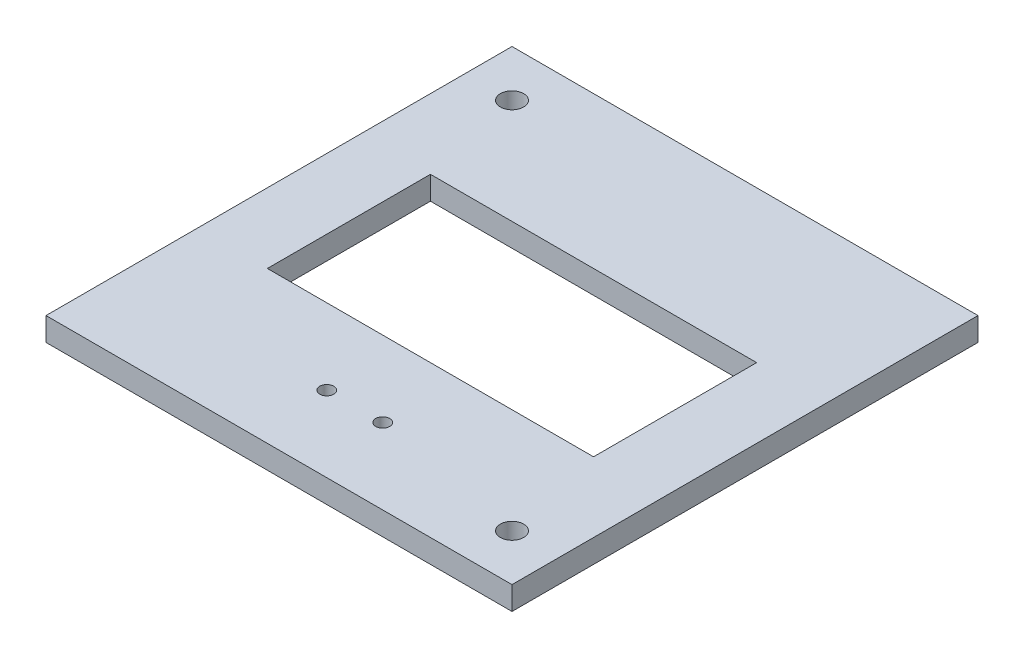
ISO-10303-21;
HEADER;
FILE_DESCRIPTION(('STEP AP214'),'2;1');
FILE_NAME('part.step','',(''),(''),'','','');
FILE_SCHEMA(('AUTOMOTIVE_DESIGN { 1 0 10303 214 1 1 1 1 }'));
ENDSEC;
DATA;
#1=APPLICATION_CONTEXT('core data for automotive mechanical design processes');
#2=APPLICATION_PROTOCOL_DEFINITION('international standard','automotive_design',2000,#1);
#3=PRODUCT_CONTEXT('',#1,'mechanical');
#4=PRODUCT('Part','Part','',(#3));
#5=PRODUCT_RELATED_PRODUCT_CATEGORY('part','',(#4));
#6=PRODUCT_DEFINITION_FORMATION('','',#4);
#7=PRODUCT_DEFINITION_CONTEXT('part definition',#1,'design');
#8=PRODUCT_DEFINITION('design','',#6,#7);
#9=PRODUCT_DEFINITION_SHAPE('','',#8);
#10=(LENGTH_UNIT() NAMED_UNIT(*) SI_UNIT(.MILLI.,.METRE.));
#11=(NAMED_UNIT(*) PLANE_ANGLE_UNIT() SI_UNIT($,.RADIAN.));
#12=(NAMED_UNIT(*) SI_UNIT($,.STERADIAN.) SOLID_ANGLE_UNIT());
#13=UNCERTAINTY_MEASURE_WITH_UNIT(LENGTH_MEASURE(1.E-05),#10,'distance_accuracy_value','');
#14=(GEOMETRIC_REPRESENTATION_CONTEXT(3) GLOBAL_UNCERTAINTY_ASSIGNED_CONTEXT((#13)) GLOBAL_UNIT_ASSIGNED_CONTEXT((#10,
#11,#12)) REPRESENTATION_CONTEXT('',''));
#15=CARTESIAN_POINT('',(0.,0.,0.));
#16=DIRECTION('',(0.,0.,1.));
#17=DIRECTION('',(1.,0.,0.));
#18=AXIS2_PLACEMENT_3D('',#15,#16,#17);
#19=CARTESIAN_POINT('',(0.,5.,0.));
#20=DIRECTION('',(0.,1.,0.));
#21=DIRECTION('',(0.,0.,1.));
#22=AXIS2_PLACEMENT_3D('',#19,#20,#21);
#23=PLANE('',#22);
#24=CARTESIAN_POINT('',(-90.,5.,-90.));
#25=DIRECTION('',(0.,1.,0.));
#26=DIRECTION('',(0.,0.,1.));
#27=AXIS2_PLACEMENT_3D('',#24,#25,#26);
#28=CIRCLE('',#27,2.50000000000001);
#29=CARTESIAN_POINT('',(-90.,5.,-87.5));
#30=VERTEX_POINT('',#29);
#31=EDGE_CURVE('E277',#30,#30,#28,.T.);
#32=ORIENTED_EDGE('',*,*,#31,.F.);
#33=EDGE_LOOP('',(#32));
#34=FACE_BOUND('',#33,.T.);
#35=CARTESIAN_POINT('',(-56.,5.,-16.25));
#36=DIRECTION('',(0.,1.,0.));
#37=DIRECTION('',(0.,0.,1.));
#38=AXIS2_PLACEMENT_3D('',#35,#36,#37);
#39=CIRCLE('',#38,1.5);
#40=CARTESIAN_POINT('',(-56.,5.,-14.75));
#41=VERTEX_POINT('',#40);
#42=EDGE_CURVE('E140',#41,#41,#39,.T.);
#43=ORIENTED_EDGE('',*,*,#42,.F.);
#44=EDGE_LOOP('',(#43));
#45=FACE_BOUND('',#44,.T.);
#46=DIRECTION('',(0.,0.,1.));
#47=VECTOR('',#46,1.);
#48=CARTESIAN_POINT('',(-100.,5.,-100.));
#49=LINE('',#48,#47);
#50=CARTESIAN_POINT('',(-100.,5.,-100.));
#51=VERTEX_POINT('',#50);
#52=CARTESIAN_POINT('',(-100.,5.,0.));
#53=VERTEX_POINT('',#52);
#54=EDGE_CURVE('E156',#51,#53,#49,.T.);
#55=ORIENTED_EDGE('',*,*,#54,.T.);
#56=DIRECTION('',(1.,0.,0.));
#57=VECTOR('',#56,1.);
#58=CARTESIAN_POINT('',(-100.,5.,0.));
#59=LINE('',#58,#57);
#60=CARTESIAN_POINT('',(0.,5.,0.));
#61=VERTEX_POINT('',#60);
#62=EDGE_CURVE('E160',#53,#61,#59,.T.);
#63=ORIENTED_EDGE('',*,*,#62,.T.);
#64=DIRECTION('',(0.,0.,-1.));
#65=VECTOR('',#64,1.);
#66=CARTESIAN_POINT('',(0.,5.,-100.));
#67=LINE('',#66,#65);
#68=CARTESIAN_POINT('',(0.,5.,-100.));
#69=VERTEX_POINT('',#68);
#70=EDGE_CURVE('E164',#61,#69,#67,.T.);
#71=ORIENTED_EDGE('',*,*,#70,.T.);
#72=DIRECTION('',(-1.,0.,0.));
#73=VECTOR('',#72,1.);
#74=CARTESIAN_POINT('',(-100.,5.,-100.));
#75=LINE('',#74,#73);
#76=EDGE_CURVE('E167',#69,#51,#75,.T.);
#77=ORIENTED_EDGE('',*,*,#76,.T.);
#78=EDGE_LOOP('',(#55,#63,#71,#77));
#79=FACE_BOUND('',#78,.T.);
#80=DIRECTION('',(1.,0.,0.));
#81=VECTOR('',#80,1.);
#82=CARTESIAN_POINT('',(-85.,5.,-32.5));
#83=LINE('',#82,#81);
#84=CARTESIAN_POINT('',(-85.,5.,-32.5));
#85=VERTEX_POINT('',#84);
#86=CARTESIAN_POINT('',(-15.,5.,-32.5));
#87=VERTEX_POINT('',#86);
#88=EDGE_CURVE('E114',#85,#87,#83,.T.);
#89=ORIENTED_EDGE('',*,*,#88,.F.);
#90=DIRECTION('',(0.,0.,1.));
#91=VECTOR('',#90,1.);
#92=CARTESIAN_POINT('',(-85.,5.,-67.5));
#93=LINE('',#92,#91);
#94=CARTESIAN_POINT('',(-85.,5.,-67.5));
#95=VERTEX_POINT('',#94);
#96=EDGE_CURVE('E105',#95,#85,#93,.T.);
#97=ORIENTED_EDGE('',*,*,#96,.F.);
#98=DIRECTION('',(-1.,0.,0.));
#99=VECTOR('',#98,1.);
#100=CARTESIAN_POINT('',(-85.,5.,-67.5));
#101=LINE('',#100,#99);
#102=CARTESIAN_POINT('',(-15.,5.,-67.5));
#103=VERTEX_POINT('',#102);
#104=EDGE_CURVE('E132',#103,#95,#101,.T.);
#105=ORIENTED_EDGE('',*,*,#104,.F.);
#106=DIRECTION('',(0.,0.,-1.));
#107=VECTOR('',#106,1.);
#108=CARTESIAN_POINT('',(-15.,5.,-67.5));
#109=LINE('',#108,#107);
#110=EDGE_CURVE('E128',#87,#103,#109,.T.);
#111=ORIENTED_EDGE('',*,*,#110,.F.);
#112=EDGE_LOOP('',(#89,#97,#105,#111));
#113=FACE_BOUND('',#112,.T.);
#114=CARTESIAN_POINT('',(-44.,5.,-16.25));
#115=DIRECTION('',(0.,1.,0.));
#116=DIRECTION('',(0.,0.,1.));
#117=AXIS2_PLACEMENT_3D('',#114,#115,#116);
#118=CIRCLE('',#117,1.5);
#119=CARTESIAN_POINT('',(-44.,5.,-14.75));
#120=VERTEX_POINT('',#119);
#121=EDGE_CURVE('E285',#120,#120,#118,.T.);
#122=ORIENTED_EDGE('',*,*,#121,.F.);
#123=EDGE_LOOP('',(#122));
#124=FACE_BOUND('',#123,.T.);
#125=CARTESIAN_POINT('',(-10.,5.,-10.));
#126=DIRECTION('',(0.,1.,0.));
#127=DIRECTION('',(0.,0.,1.));
#128=AXIS2_PLACEMENT_3D('',#125,#126,#127);
#129=CIRCLE('',#128,2.5);
#130=CARTESIAN_POINT('',(-10.,5.,-7.5));
#131=VERTEX_POINT('',#130);
#132=EDGE_CURVE('E266',#131,#131,#129,.T.);
#133=ORIENTED_EDGE('',*,*,#132,.F.);
#134=EDGE_LOOP('',(#133));
#135=FACE_BOUND('',#134,.T.);
#136=ADVANCED_FACE('F39',(#34,#45,#79,#113,#124,#135),#23,.T.);
#137=CARTESIAN_POINT('',(0.,0.,0.));
#138=DIRECTION('',(0.,1.,0.));
#139=DIRECTION('',(0.,0.,1.));
#140=AXIS2_PLACEMENT_3D('',#137,#138,#139);
#141=PLANE('',#140);
#142=DIRECTION('',(0.,0.,1.));
#143=VECTOR('',#142,1.);
#144=CARTESIAN_POINT('',(-100.,0.,-100.));
#145=LINE('',#144,#143);
#146=CARTESIAN_POINT('',(-100.,0.,-100.));
#147=VERTEX_POINT('',#146);
#148=CARTESIAN_POINT('',(-100.,0.,0.));
#149=VERTEX_POINT('',#148);
#150=EDGE_CURVE('E123',#147,#149,#145,.T.);
#151=ORIENTED_EDGE('',*,*,#150,.F.);
#152=DIRECTION('',(-1.,0.,0.));
#153=VECTOR('',#152,1.);
#154=CARTESIAN_POINT('',(-100.,0.,-100.));
#155=LINE('',#154,#153);
#156=CARTESIAN_POINT('',(0.,0.,-100.));
#157=VERTEX_POINT('',#156);
#158=EDGE_CURVE('E161',#157,#147,#155,.T.);
#159=ORIENTED_EDGE('',*,*,#158,.F.);
#160=DIRECTION('',(0.,0.,-1.));
#161=VECTOR('',#160,1.);
#162=CARTESIAN_POINT('',(0.,0.,-100.));
#163=LINE('',#162,#161);
#164=CARTESIAN_POINT('',(0.,0.,0.));
#165=VERTEX_POINT('',#164);
#166=EDGE_CURVE('E177',#165,#157,#163,.T.);
#167=ORIENTED_EDGE('',*,*,#166,.F.);
#168=DIRECTION('',(1.,0.,0.));
#169=VECTOR('',#168,1.);
#170=CARTESIAN_POINT('',(-100.,0.,0.));
#171=LINE('',#170,#169);
#172=EDGE_CURVE('E174',#149,#165,#171,.T.);
#173=ORIENTED_EDGE('',*,*,#172,.F.);
#174=EDGE_LOOP('',(#151,#159,#167,#173));
#175=FACE_BOUND('',#174,.T.);
#176=DIRECTION('',(0.,0.,1.));
#177=VECTOR('',#176,1.);
#178=CARTESIAN_POINT('',(-85.,0.,-67.5));
#179=LINE('',#178,#177);
#180=CARTESIAN_POINT('',(-85.,0.,-67.5));
#181=VERTEX_POINT('',#180);
#182=CARTESIAN_POINT('',(-85.,0.,-32.5));
#183=VERTEX_POINT('',#182);
#184=EDGE_CURVE('E63',#181,#183,#179,.T.);
#185=ORIENTED_EDGE('',*,*,#184,.T.);
#186=DIRECTION('',(1.,0.,0.));
#187=VECTOR('',#186,1.);
#188=CARTESIAN_POINT('',(-85.,0.,-32.5));
#189=LINE('',#188,#187);
#190=CARTESIAN_POINT('',(-15.,0.,-32.5));
#191=VERTEX_POINT('',#190);
#192=EDGE_CURVE('E121',#183,#191,#189,.T.);
#193=ORIENTED_EDGE('',*,*,#192,.T.);
#194=DIRECTION('',(0.,0.,-1.));
#195=VECTOR('',#194,1.);
#196=CARTESIAN_POINT('',(-15.,0.,-67.5));
#197=LINE('',#196,#195);
#198=CARTESIAN_POINT('',(-15.,0.,-67.5));
#199=VERTEX_POINT('',#198);
#200=EDGE_CURVE('E143',#191,#199,#197,.T.);
#201=ORIENTED_EDGE('',*,*,#200,.T.);
#202=DIRECTION('',(-1.,0.,0.));
#203=VECTOR('',#202,1.);
#204=CARTESIAN_POINT('',(-85.,0.,-67.5));
#205=LINE('',#204,#203);
#206=EDGE_CURVE('E115',#199,#181,#205,.T.);
#207=ORIENTED_EDGE('',*,*,#206,.T.);
#208=EDGE_LOOP('',(#185,#193,#201,#207));
#209=FACE_BOUND('',#208,.T.);
#210=CARTESIAN_POINT('',(-56.,0.,-16.25));
#211=DIRECTION('',(0.,1.,0.));
#212=DIRECTION('',(0.,0.,1.));
#213=AXIS2_PLACEMENT_3D('',#210,#211,#212);
#214=CIRCLE('',#213,1.5);
#215=CARTESIAN_POINT('',(-56.,0.,-14.75));
#216=VERTEX_POINT('',#215);
#217=EDGE_CURVE('E289',#216,#216,#214,.T.);
#218=ORIENTED_EDGE('',*,*,#217,.T.);
#219=EDGE_LOOP('',(#218));
#220=FACE_BOUND('',#219,.T.);
#221=CARTESIAN_POINT('',(-44.,0.,-16.25));
#222=DIRECTION('',(0.,1.,0.));
#223=DIRECTION('',(0.,0.,1.));
#224=AXIS2_PLACEMENT_3D('',#221,#222,#223);
#225=CIRCLE('',#224,1.5);
#226=CARTESIAN_POINT('',(-44.,0.,-14.75));
#227=VERTEX_POINT('',#226);
#228=EDGE_CURVE('E281',#227,#227,#225,.T.);
#229=ORIENTED_EDGE('',*,*,#228,.T.);
#230=EDGE_LOOP('',(#229));
#231=FACE_BOUND('',#230,.T.);
#232=CARTESIAN_POINT('',(-90.,0.,-90.));
#233=DIRECTION('',(0.,1.,0.));
#234=DIRECTION('',(0.,0.,1.));
#235=AXIS2_PLACEMENT_3D('',#232,#233,#234);
#236=CIRCLE('',#235,2.50000000000001);
#237=CARTESIAN_POINT('',(-90.,0.,-87.5));
#238=VERTEX_POINT('',#237);
#239=EDGE_CURVE('E274',#238,#238,#236,.T.);
#240=ORIENTED_EDGE('',*,*,#239,.T.);
#241=EDGE_LOOP('',(#240));
#242=FACE_BOUND('',#241,.T.);
#243=CARTESIAN_POINT('',(-10.,0.,-10.));
#244=DIRECTION('',(0.,1.,0.));
#245=DIRECTION('',(0.,0.,1.));
#246=AXIS2_PLACEMENT_3D('',#243,#244,#245);
#247=CIRCLE('',#246,2.5);
#248=CARTESIAN_POINT('',(-10.,0.,-7.5));
#249=VERTEX_POINT('',#248);
#250=EDGE_CURVE('E269',#249,#249,#247,.T.);
#251=ORIENTED_EDGE('',*,*,#250,.T.);
#252=EDGE_LOOP('',(#251));
#253=FACE_BOUND('',#252,.T.);
#254=ADVANCED_FACE('F200',(#175,#209,#220,#231,#242,#253),#141,.F.);
#255=CARTESIAN_POINT('',(-100.,5.,-100.));
#256=DIRECTION('',(1.,0.,0.));
#257=DIRECTION('',(0.,0.,-1.));
#258=AXIS2_PLACEMENT_3D('',#255,#256,#257);
#259=PLANE('',#258);
#260=ORIENTED_EDGE('',*,*,#150,.T.);
#261=DIRECTION('',(0.,-1.,0.));
#262=VECTOR('',#261,1.);
#263=CARTESIAN_POINT('',(-100.,5.,0.));
#264=LINE('',#263,#262);
#265=EDGE_CURVE('E11',#53,#149,#264,.T.);
#266=ORIENTED_EDGE('',*,*,#265,.F.);
#267=ORIENTED_EDGE('',*,*,#54,.F.);
#268=DIRECTION('',(0.,-1.,0.));
#269=VECTOR('',#268,1.);
#270=CARTESIAN_POINT('',(-100.,5.,-100.));
#271=LINE('',#270,#269);
#272=EDGE_CURVE('E170',#51,#147,#271,.T.);
#273=ORIENTED_EDGE('',*,*,#272,.T.);
#274=EDGE_LOOP('',(#260,#266,#267,#273));
#275=FACE_BOUND('',#274,.T.);
#276=ADVANCED_FACE('F41',(#275),#259,.F.);
#277=CARTESIAN_POINT('',(-100.,5.,0.));
#278=DIRECTION('',(0.,0.,-1.));
#279=DIRECTION('',(-1.,0.,0.));
#280=AXIS2_PLACEMENT_3D('',#277,#278,#279);
#281=PLANE('',#280);
#282=ORIENTED_EDGE('',*,*,#172,.T.);
#283=DIRECTION('',(0.,-1.,0.));
#284=VECTOR('',#283,1.);
#285=CARTESIAN_POINT('',(0.,5.,0.));
#286=LINE('',#285,#284);
#287=EDGE_CURVE('E48',#61,#165,#286,.T.);
#288=ORIENTED_EDGE('',*,*,#287,.F.);
#289=ORIENTED_EDGE('',*,*,#62,.F.);
#290=ORIENTED_EDGE('',*,*,#265,.T.);
#291=EDGE_LOOP('',(#282,#288,#289,#290));
#292=FACE_BOUND('',#291,.T.);
#293=ADVANCED_FACE('F210',(#292),#281,.F.);
#294=CARTESIAN_POINT('',(0.,5.,-100.));
#295=DIRECTION('',(-1.,0.,0.));
#296=DIRECTION('',(0.,0.,1.));
#297=AXIS2_PLACEMENT_3D('',#294,#295,#296);
#298=PLANE('',#297);
#299=ORIENTED_EDGE('',*,*,#166,.T.);
#300=DIRECTION('',(0.,-1.,0.));
#301=VECTOR('',#300,1.);
#302=CARTESIAN_POINT('',(0.,5.,-100.));
#303=LINE('',#302,#301);
#304=EDGE_CURVE('E185',#69,#157,#303,.T.);
#305=ORIENTED_EDGE('',*,*,#304,.F.);
#306=ORIENTED_EDGE('',*,*,#70,.F.);
#307=ORIENTED_EDGE('',*,*,#287,.T.);
#308=EDGE_LOOP('',(#299,#305,#306,#307));
#309=FACE_BOUND('',#308,.T.);
#310=ADVANCED_FACE('F194',(#309),#298,.F.);
#311=CARTESIAN_POINT('',(-100.,5.,-100.));
#312=DIRECTION('',(0.,0.,1.));
#313=DIRECTION('',(1.,0.,0.));
#314=AXIS2_PLACEMENT_3D('',#311,#312,#313);
#315=PLANE('',#314);
#316=ORIENTED_EDGE('',*,*,#158,.T.);
#317=ORIENTED_EDGE('',*,*,#272,.F.);
#318=ORIENTED_EDGE('',*,*,#76,.F.);
#319=ORIENTED_EDGE('',*,*,#304,.T.);
#320=EDGE_LOOP('',(#316,#317,#318,#319));
#321=FACE_BOUND('',#320,.T.);
#322=ADVANCED_FACE('F204',(#321),#315,.F.);
#323=CARTESIAN_POINT('',(-85.,5.,-67.5));
#324=DIRECTION('',(1.,0.,0.));
#325=DIRECTION('',(0.,0.,-1.));
#326=AXIS2_PLACEMENT_3D('',#323,#324,#325);
#327=PLANE('',#326);
#328=ORIENTED_EDGE('',*,*,#184,.F.);
#329=DIRECTION('',(0.,-1.,0.));
#330=VECTOR('',#329,1.);
#331=CARTESIAN_POINT('',(-85.,5.,-67.5));
#332=LINE('',#331,#330);
#333=EDGE_CURVE('E109',#95,#181,#332,.T.);
#334=ORIENTED_EDGE('',*,*,#333,.F.);
#335=ORIENTED_EDGE('',*,*,#96,.T.);
#336=DIRECTION('',(0.,-1.,0.));
#337=VECTOR('',#336,1.);
#338=CARTESIAN_POINT('',(-85.,5.,-32.5));
#339=LINE('',#338,#337);
#340=EDGE_CURVE('E108',#85,#183,#339,.T.);
#341=ORIENTED_EDGE('',*,*,#340,.T.);
#342=EDGE_LOOP('',(#328,#334,#335,#341));
#343=FACE_BOUND('',#342,.T.);
#344=ADVANCED_FACE('F107',(#343),#327,.T.);
#345=CARTESIAN_POINT('',(-85.,5.,-32.5));
#346=DIRECTION('',(0.,0.,-1.));
#347=DIRECTION('',(-1.,0.,0.));
#348=AXIS2_PLACEMENT_3D('',#345,#346,#347);
#349=PLANE('',#348);
#350=ORIENTED_EDGE('',*,*,#192,.F.);
#351=ORIENTED_EDGE('',*,*,#340,.F.);
#352=ORIENTED_EDGE('',*,*,#88,.T.);
#353=DIRECTION('',(0.,-1.,0.));
#354=VECTOR('',#353,1.);
#355=CARTESIAN_POINT('',(-15.,5.,-32.5));
#356=LINE('',#355,#354);
#357=EDGE_CURVE('E124',#87,#191,#356,.T.);
#358=ORIENTED_EDGE('',*,*,#357,.T.);
#359=EDGE_LOOP('',(#350,#351,#352,#358));
#360=FACE_BOUND('',#359,.T.);
#361=ADVANCED_FACE('F118',(#360),#349,.T.);
#362=CARTESIAN_POINT('',(-15.,5.,-67.5));
#363=DIRECTION('',(-1.,0.,0.));
#364=DIRECTION('',(0.,0.,1.));
#365=AXIS2_PLACEMENT_3D('',#362,#363,#364);
#366=PLANE('',#365);
#367=ORIENTED_EDGE('',*,*,#200,.F.);
#368=ORIENTED_EDGE('',*,*,#357,.F.);
#369=ORIENTED_EDGE('',*,*,#110,.T.);
#370=DIRECTION('',(0.,-1.,0.));
#371=VECTOR('',#370,1.);
#372=CARTESIAN_POINT('',(-15.,5.,-67.5));
#373=LINE('',#372,#371);
#374=EDGE_CURVE('E55',#103,#199,#373,.T.);
#375=ORIENTED_EDGE('',*,*,#374,.T.);
#376=EDGE_LOOP('',(#367,#368,#369,#375));
#377=FACE_BOUND('',#376,.T.);
#378=ADVANCED_FACE('F236',(#377),#366,.T.);
#379=CARTESIAN_POINT('',(-85.,5.,-67.5));
#380=DIRECTION('',(0.,0.,1.));
#381=DIRECTION('',(1.,0.,0.));
#382=AXIS2_PLACEMENT_3D('',#379,#380,#381);
#383=PLANE('',#382);
#384=ORIENTED_EDGE('',*,*,#206,.F.);
#385=ORIENTED_EDGE('',*,*,#374,.F.);
#386=ORIENTED_EDGE('',*,*,#104,.T.);
#387=ORIENTED_EDGE('',*,*,#333,.T.);
#388=EDGE_LOOP('',(#384,#385,#386,#387));
#389=FACE_BOUND('',#388,.T.);
#390=ADVANCED_FACE('F240',(#389),#383,.T.);
#391=CARTESIAN_POINT('',(-56.,5.,-16.25));
#392=DIRECTION('',(0.,-1.,0.));
#393=DIRECTION('',(0.,0.,-1.));
#394=AXIS2_PLACEMENT_3D('',#391,#392,#393);
#395=CYLINDRICAL_SURFACE('',#394,1.5);
#396=ORIENTED_EDGE('',*,*,#42,.T.);
#397=EDGE_LOOP('',(#396));
#398=FACE_BOUND('',#397,.T.);
#399=ORIENTED_EDGE('',*,*,#217,.F.);
#400=EDGE_LOOP('',(#399));
#401=FACE_BOUND('',#400,.T.);
#402=ADVANCED_FACE('F246',(#398,#401),#395,.F.);
#403=CARTESIAN_POINT('',(-44.,5.,-16.25));
#404=DIRECTION('',(0.,-1.,0.));
#405=DIRECTION('',(0.,0.,-1.));
#406=AXIS2_PLACEMENT_3D('',#403,#404,#405);
#407=CYLINDRICAL_SURFACE('',#406,1.5);
#408=ORIENTED_EDGE('',*,*,#121,.T.);
#409=EDGE_LOOP('',(#408));
#410=FACE_BOUND('',#409,.T.);
#411=ORIENTED_EDGE('',*,*,#228,.F.);
#412=EDGE_LOOP('',(#411));
#413=FACE_BOUND('',#412,.T.);
#414=ADVANCED_FACE('F249',(#410,#413),#407,.F.);
#415=CARTESIAN_POINT('',(-90.,5.,-90.));
#416=DIRECTION('',(0.,-1.,0.));
#417=DIRECTION('',(0.,0.,-1.));
#418=AXIS2_PLACEMENT_3D('',#415,#416,#417);
#419=CYLINDRICAL_SURFACE('',#418,2.50000000000001);
#420=ORIENTED_EDGE('',*,*,#31,.T.);
#421=EDGE_LOOP('',(#420));
#422=FACE_BOUND('',#421,.T.);
#423=ORIENTED_EDGE('',*,*,#239,.F.);
#424=EDGE_LOOP('',(#423));
#425=FACE_BOUND('',#424,.T.);
#426=ADVANCED_FACE('F253',(#422,#425),#419,.F.);
#427=CARTESIAN_POINT('',(-10.,5.,-10.));
#428=DIRECTION('',(0.,-1.,0.));
#429=DIRECTION('',(0.,0.,-1.));
#430=AXIS2_PLACEMENT_3D('',#427,#428,#429);
#431=CYLINDRICAL_SURFACE('',#430,2.5);
#432=ORIENTED_EDGE('',*,*,#132,.T.);
#433=EDGE_LOOP('',(#432));
#434=FACE_BOUND('',#433,.T.);
#435=ORIENTED_EDGE('',*,*,#250,.F.);
#436=EDGE_LOOP('',(#435));
#437=FACE_BOUND('',#436,.T.);
#438=ADVANCED_FACE('F257',(#434,#437),#431,.F.);
#439=CLOSED_SHELL('',(#136,#254,#276,#293,#310,#322,#344,#361,#378,#390,#402,#414,#426,#438));
#440=MANIFOLD_SOLID_BREP('B2',#439);
#441=ADVANCED_BREP_SHAPE_REPRESENTATION('',(#18,#440),#14);
#442=SHAPE_DEFINITION_REPRESENTATION(#9,#441);
ENDSEC;
END-ISO-10303-21;
